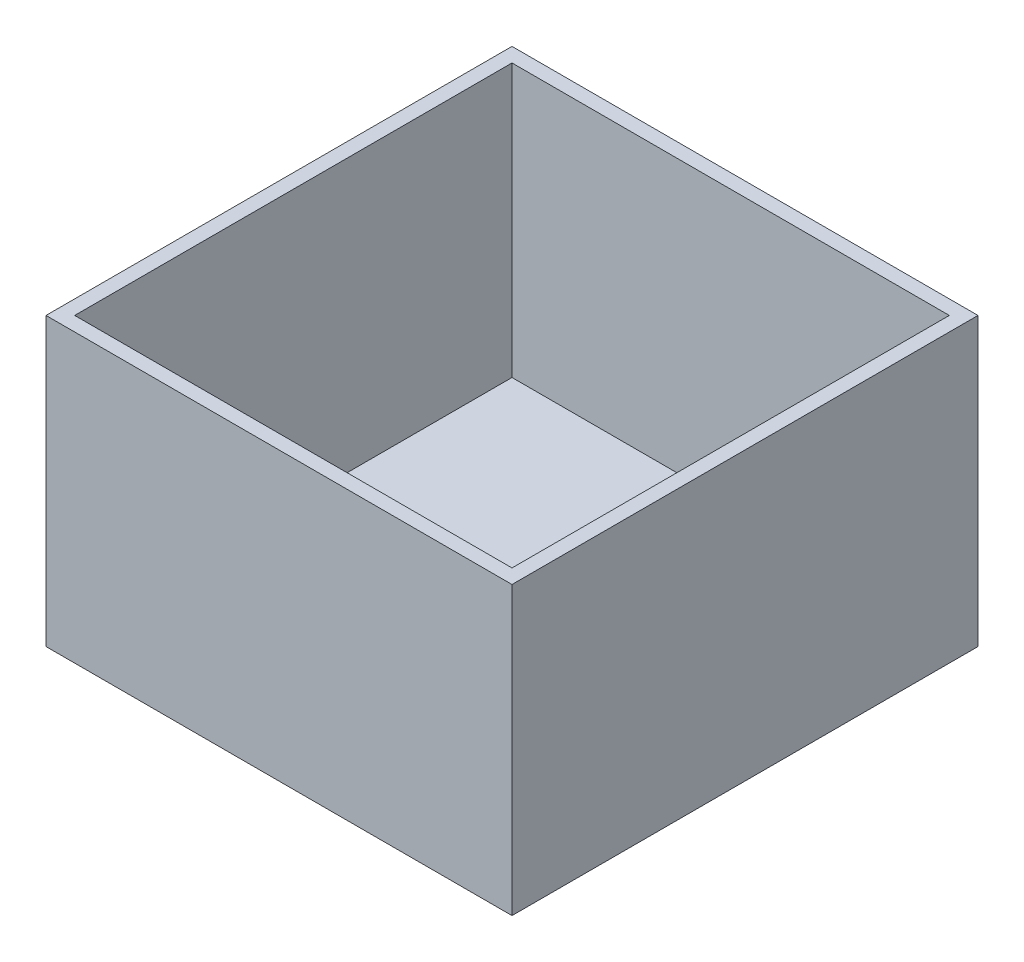
ISO-10303-21;
HEADER;
FILE_DESCRIPTION(('STEP AP214'),'2;1');
FILE_NAME('part.step','',(''),(''),'','','');
FILE_SCHEMA(('AUTOMOTIVE_DESIGN { 1 0 10303 214 1 1 1 1 }'));
ENDSEC;
DATA;
#1=APPLICATION_CONTEXT('core data for automotive mechanical design processes');
#2=APPLICATION_PROTOCOL_DEFINITION('international standard','automotive_design',2000,#1);
#3=PRODUCT_CONTEXT('',#1,'mechanical');
#4=PRODUCT('Part','Part','',(#3));
#5=PRODUCT_RELATED_PRODUCT_CATEGORY('part','',(#4));
#6=PRODUCT_DEFINITION_FORMATION('','',#4);
#7=PRODUCT_DEFINITION_CONTEXT('part definition',#1,'design');
#8=PRODUCT_DEFINITION('design','',#6,#7);
#9=PRODUCT_DEFINITION_SHAPE('','',#8);
#10=(LENGTH_UNIT() NAMED_UNIT(*) SI_UNIT(.MILLI.,.METRE.));
#11=(NAMED_UNIT(*) PLANE_ANGLE_UNIT() SI_UNIT($,.RADIAN.));
#12=(NAMED_UNIT(*) SI_UNIT($,.STERADIAN.) SOLID_ANGLE_UNIT());
#13=UNCERTAINTY_MEASURE_WITH_UNIT(LENGTH_MEASURE(1.E-05),#10,'distance_accuracy_value','');
#14=(GEOMETRIC_REPRESENTATION_CONTEXT(3) GLOBAL_UNCERTAINTY_ASSIGNED_CONTEXT((#13)) GLOBAL_UNIT_ASSIGNED_CONTEXT((#10,
#11,#12)) REPRESENTATION_CONTEXT('',''));
#15=CARTESIAN_POINT('',(0.,0.,0.));
#16=DIRECTION('',(0.,0.,1.));
#17=DIRECTION('',(1.,0.,0.));
#18=AXIS2_PLACEMENT_3D('',#15,#16,#17);
#19=CARTESIAN_POINT('',(0.,50.8,0.));
#20=DIRECTION('',(1.,0.,0.));
#21=DIRECTION('',(0.,0.,-1.));
#22=AXIS2_PLACEMENT_3D('',#19,#20,#21);
#23=PLANE('',#22);
#24=DIRECTION('',(0.,0.,1.));
#25=VECTOR('',#24,1.);
#26=CARTESIAN_POINT('',(0.,0.,0.));
#27=LINE('',#26,#25);
#28=CARTESIAN_POINT('',(0.,0.,0.));
#29=VERTEX_POINT('',#28);
#30=CARTESIAN_POINT('',(0.,0.,82.55));
#31=VERTEX_POINT('',#30);
#32=EDGE_CURVE('E148',#29,#31,#27,.T.);
#33=ORIENTED_EDGE('',*,*,#32,.T.);
#34=DIRECTION('',(0.,-1.,0.));
#35=VECTOR('',#34,1.);
#36=CARTESIAN_POINT('',(0.,50.8,82.55));
#37=LINE('',#36,#35);
#38=CARTESIAN_POINT('',(0.,50.8,82.55));
#39=VERTEX_POINT('',#38);
#40=EDGE_CURVE('E11',#39,#31,#37,.T.);
#41=ORIENTED_EDGE('',*,*,#40,.F.);
#42=DIRECTION('',(0.,0.,1.));
#43=VECTOR('',#42,1.);
#44=CARTESIAN_POINT('',(0.,50.8,0.));
#45=LINE('',#44,#43);
#46=CARTESIAN_POINT('',(0.,50.8,0.));
#47=VERTEX_POINT('',#46);
#48=EDGE_CURVE('E141',#47,#39,#45,.T.);
#49=ORIENTED_EDGE('',*,*,#48,.F.);
#50=DIRECTION('',(0.,-1.,0.));
#51=VECTOR('',#50,1.);
#52=CARTESIAN_POINT('',(0.,50.8,0.));
#53=LINE('',#52,#51);
#54=EDGE_CURVE('E147',#47,#29,#53,.T.);
#55=ORIENTED_EDGE('',*,*,#54,.T.);
#56=EDGE_LOOP('',(#33,#41,#49,#55));
#57=FACE_BOUND('',#56,.T.);
#58=ADVANCED_FACE('F34',(#57),#23,.F.);
#59=CARTESIAN_POINT('',(0.,50.8,82.55));
#60=DIRECTION('',(0.,0.,-1.));
#61=DIRECTION('',(-1.,0.,0.));
#62=AXIS2_PLACEMENT_3D('',#59,#60,#61);
#63=PLANE('',#62);
#64=DIRECTION('',(1.,0.,0.));
#65=VECTOR('',#64,1.);
#66=CARTESIAN_POINT('',(0.,0.,82.55));
#67=LINE('',#66,#65);
#68=CARTESIAN_POINT('',(82.55,0.,82.55));
#69=VERTEX_POINT('',#68);
#70=EDGE_CURVE('E151',#31,#69,#67,.T.);
#71=ORIENTED_EDGE('',*,*,#70,.T.);
#72=DIRECTION('',(0.,-1.,0.));
#73=VECTOR('',#72,1.);
#74=CARTESIAN_POINT('',(82.55,50.8,82.55));
#75=LINE('',#74,#73);
#76=CARTESIAN_POINT('',(82.55,50.8,82.55));
#77=VERTEX_POINT('',#76);
#78=EDGE_CURVE('E41',#77,#69,#75,.T.);
#79=ORIENTED_EDGE('',*,*,#78,.F.);
#80=DIRECTION('',(1.,0.,0.));
#81=VECTOR('',#80,1.);
#82=CARTESIAN_POINT('',(0.,50.8,82.55));
#83=LINE('',#82,#81);
#84=EDGE_CURVE('E85',#39,#77,#83,.T.);
#85=ORIENTED_EDGE('',*,*,#84,.F.);
#86=ORIENTED_EDGE('',*,*,#40,.T.);
#87=EDGE_LOOP('',(#71,#79,#85,#86));
#88=FACE_BOUND('',#87,.T.);
#89=ADVANCED_FACE('F180',(#88),#63,.F.);
#90=CARTESIAN_POINT('',(82.55,50.8,0.));
#91=DIRECTION('',(-1.,0.,0.));
#92=DIRECTION('',(0.,0.,1.));
#93=AXIS2_PLACEMENT_3D('',#90,#91,#92);
#94=PLANE('',#93);
#95=DIRECTION('',(0.,0.,-1.));
#96=VECTOR('',#95,1.);
#97=CARTESIAN_POINT('',(82.55,0.,0.));
#98=LINE('',#97,#96);
#99=CARTESIAN_POINT('',(82.55,0.,0.));
#100=VERTEX_POINT('',#99);
#101=EDGE_CURVE('E153',#69,#100,#98,.T.);
#102=ORIENTED_EDGE('',*,*,#101,.T.);
#103=DIRECTION('',(0.,-1.,0.));
#104=VECTOR('',#103,1.);
#105=CARTESIAN_POINT('',(82.55,50.8,0.));
#106=LINE('',#105,#104);
#107=CARTESIAN_POINT('',(82.55,50.8,0.));
#108=VERTEX_POINT('',#107);
#109=EDGE_CURVE('E157',#108,#100,#106,.T.);
#110=ORIENTED_EDGE('',*,*,#109,.F.);
#111=DIRECTION('',(0.,0.,-1.));
#112=VECTOR('',#111,1.);
#113=CARTESIAN_POINT('',(82.55,50.8,0.));
#114=LINE('',#113,#112);
#115=EDGE_CURVE('E144',#77,#108,#114,.T.);
#116=ORIENTED_EDGE('',*,*,#115,.F.);
#117=ORIENTED_EDGE('',*,*,#78,.T.);
#118=EDGE_LOOP('',(#102,#110,#116,#117));
#119=FACE_BOUND('',#118,.T.);
#120=ADVANCED_FACE('F162',(#119),#94,.F.);
#121=CARTESIAN_POINT('',(0.,50.8,0.));
#122=DIRECTION('',(0.,0.,1.));
#123=DIRECTION('',(1.,0.,0.));
#124=AXIS2_PLACEMENT_3D('',#121,#122,#123);
#125=PLANE('',#124);
#126=DIRECTION('',(-1.,0.,0.));
#127=VECTOR('',#126,1.);
#128=CARTESIAN_POINT('',(0.,0.,0.));
#129=LINE('',#128,#127);
#130=EDGE_CURVE('E78',#100,#29,#129,.T.);
#131=ORIENTED_EDGE('',*,*,#130,.T.);
#132=ORIENTED_EDGE('',*,*,#54,.F.);
#133=DIRECTION('',(-1.,0.,0.));
#134=VECTOR('',#133,1.);
#135=CARTESIAN_POINT('',(0.,50.8,0.));
#136=LINE('',#135,#134);
#137=EDGE_CURVE('E57',#108,#47,#136,.T.);
#138=ORIENTED_EDGE('',*,*,#137,.F.);
#139=ORIENTED_EDGE('',*,*,#109,.T.);
#140=EDGE_LOOP('',(#131,#132,#138,#139));
#141=FACE_BOUND('',#140,.T.);
#142=ADVANCED_FACE('F170',(#141),#125,.F.);
#143=CARTESIAN_POINT('',(0.,50.8,0.));
#144=DIRECTION('',(0.,1.,0.));
#145=DIRECTION('',(0.,0.,1.));
#146=AXIS2_PLACEMENT_3D('',#143,#144,#145);
#147=PLANE('',#146);
#148=DIRECTION('',(0.,0.,1.));
#149=VECTOR('',#148,1.);
#150=CARTESIAN_POINT('',(2.54,50.8,0.));
#151=LINE('',#150,#149);
#152=CARTESIAN_POINT('',(2.54,50.8,2.54));
#153=VERTEX_POINT('',#152);
#154=CARTESIAN_POINT('',(2.54000000000001,50.8,80.01));
#155=VERTEX_POINT('',#154);
#156=EDGE_CURVE('E130',#153,#155,#151,.T.);
#157=ORIENTED_EDGE('',*,*,#156,.F.);
#158=DIRECTION('',(-1.,0.,0.));
#159=VECTOR('',#158,1.);
#160=CARTESIAN_POINT('',(0.,50.8,2.54));
#161=LINE('',#160,#159);
#162=CARTESIAN_POINT('',(80.01,50.8,2.54));
#163=VERTEX_POINT('',#162);
#164=EDGE_CURVE('E139',#163,#153,#161,.T.);
#165=ORIENTED_EDGE('',*,*,#164,.F.);
#166=DIRECTION('',(0.,0.,-1.));
#167=VECTOR('',#166,1.);
#168=CARTESIAN_POINT('',(80.01,50.8,0.));
#169=LINE('',#168,#167);
#170=CARTESIAN_POINT('',(80.01,50.8,80.01));
#171=VERTEX_POINT('',#170);
#172=EDGE_CURVE('E137',#171,#163,#169,.T.);
#173=ORIENTED_EDGE('',*,*,#172,.F.);
#174=DIRECTION('',(1.,0.,0.));
#175=VECTOR('',#174,1.);
#176=CARTESIAN_POINT('',(0.,50.8,80.01));
#177=LINE('',#176,#175);
#178=EDGE_CURVE('E122',#155,#171,#177,.T.);
#179=ORIENTED_EDGE('',*,*,#178,.F.);
#180=EDGE_LOOP('',(#157,#165,#173,#179));
#181=FACE_BOUND('',#180,.T.);
#182=ORIENTED_EDGE('',*,*,#48,.T.);
#183=ORIENTED_EDGE('',*,*,#84,.T.);
#184=ORIENTED_EDGE('',*,*,#115,.T.);
#185=ORIENTED_EDGE('',*,*,#137,.T.);
#186=EDGE_LOOP('',(#182,#183,#184,#185));
#187=FACE_BOUND('',#186,.T.);
#188=ADVANCED_FACE('F172',(#181,#187),#147,.T.);
#189=CARTESIAN_POINT('',(0.,0.,0.));
#190=DIRECTION('',(0.,1.,0.));
#191=DIRECTION('',(0.,0.,1.));
#192=AXIS2_PLACEMENT_3D('',#189,#190,#191);
#193=PLANE('',#192);
#194=ORIENTED_EDGE('',*,*,#32,.F.);
#195=ORIENTED_EDGE('',*,*,#130,.F.);
#196=ORIENTED_EDGE('',*,*,#101,.F.);
#197=ORIENTED_EDGE('',*,*,#70,.F.);
#198=EDGE_LOOP('',(#194,#195,#196,#197));
#199=FACE_BOUND('',#198,.T.);
#200=ADVANCED_FACE('F166',(#199),#193,.F.);
#201=CARTESIAN_POINT('',(2.54,50.8,0.));
#202=DIRECTION('',(1.,0.,0.));
#203=DIRECTION('',(0.,0.,-1.));
#204=AXIS2_PLACEMENT_3D('',#201,#202,#203);
#205=PLANE('',#204);
#206=DIRECTION('',(0.,0.,1.));
#207=VECTOR('',#206,1.);
#208=CARTESIAN_POINT('',(2.54,2.54,0.));
#209=LINE('',#208,#207);
#210=CARTESIAN_POINT('',(2.54,2.54,2.54));
#211=VERTEX_POINT('',#210);
#212=CARTESIAN_POINT('',(2.54000000000001,2.54,80.01));
#213=VERTEX_POINT('',#212);
#214=EDGE_CURVE('E113',#211,#213,#209,.T.);
#215=ORIENTED_EDGE('',*,*,#214,.F.);
#216=DIRECTION('',(0.,-1.,0.));
#217=VECTOR('',#216,1.);
#218=CARTESIAN_POINT('',(2.54,50.8,2.54));
#219=LINE('',#218,#217);
#220=EDGE_CURVE('E133',#153,#211,#219,.T.);
#221=ORIENTED_EDGE('',*,*,#220,.F.);
#222=ORIENTED_EDGE('',*,*,#156,.T.);
#223=DIRECTION('',(0.,-1.,0.));
#224=VECTOR('',#223,1.);
#225=CARTESIAN_POINT('',(2.54000000000001,50.8,80.01));
#226=LINE('',#225,#224);
#227=EDGE_CURVE('E125',#155,#213,#226,.T.);
#228=ORIENTED_EDGE('',*,*,#227,.T.);
#229=EDGE_LOOP('',(#215,#221,#222,#228));
#230=FACE_BOUND('',#229,.T.);
#231=ADVANCED_FACE('F207',(#230),#205,.T.);
#232=CARTESIAN_POINT('',(0.,50.8,80.01));
#233=DIRECTION('',(0.,0.,-1.));
#234=DIRECTION('',(-1.,0.,0.));
#235=AXIS2_PLACEMENT_3D('',#232,#233,#234);
#236=PLANE('',#235);
#237=DIRECTION('',(1.,0.,0.));
#238=VECTOR('',#237,1.);
#239=CARTESIAN_POINT('',(0.,2.54,80.01));
#240=LINE('',#239,#238);
#241=CARTESIAN_POINT('',(80.01,2.54,80.01));
#242=VERTEX_POINT('',#241);
#243=EDGE_CURVE('E107',#213,#242,#240,.T.);
#244=ORIENTED_EDGE('',*,*,#243,.F.);
#245=ORIENTED_EDGE('',*,*,#227,.F.);
#246=ORIENTED_EDGE('',*,*,#178,.T.);
#247=DIRECTION('',(0.,-1.,0.));
#248=VECTOR('',#247,1.);
#249=CARTESIAN_POINT('',(80.01,50.8,80.01));
#250=LINE('',#249,#248);
#251=EDGE_CURVE('E119',#171,#242,#250,.T.);
#252=ORIENTED_EDGE('',*,*,#251,.T.);
#253=EDGE_LOOP('',(#244,#245,#246,#252));
#254=FACE_BOUND('',#253,.T.);
#255=ADVANCED_FACE('F120',(#254),#236,.T.);
#256=CARTESIAN_POINT('',(80.01,50.8,0.));
#257=DIRECTION('',(-1.,0.,0.));
#258=DIRECTION('',(0.,0.,1.));
#259=AXIS2_PLACEMENT_3D('',#256,#257,#258);
#260=PLANE('',#259);
#261=DIRECTION('',(0.,0.,-1.));
#262=VECTOR('',#261,1.);
#263=CARTESIAN_POINT('',(80.01,2.54,0.));
#264=LINE('',#263,#262);
#265=CARTESIAN_POINT('',(80.01,2.54,2.54));
#266=VERTEX_POINT('',#265);
#267=EDGE_CURVE('E111',#242,#266,#264,.T.);
#268=ORIENTED_EDGE('',*,*,#267,.F.);
#269=ORIENTED_EDGE('',*,*,#251,.F.);
#270=ORIENTED_EDGE('',*,*,#172,.T.);
#271=DIRECTION('',(0.,-1.,0.));
#272=VECTOR('',#271,1.);
#273=CARTESIAN_POINT('',(80.01,50.8,2.54));
#274=LINE('',#273,#272);
#275=EDGE_CURVE('E48',#163,#266,#274,.T.);
#276=ORIENTED_EDGE('',*,*,#275,.T.);
#277=EDGE_LOOP('',(#268,#269,#270,#276));
#278=FACE_BOUND('',#277,.T.);
#279=ADVANCED_FACE('F127',(#278),#260,.T.);
#280=CARTESIAN_POINT('',(0.,50.8,2.54));
#281=DIRECTION('',(0.,0.,1.));
#282=DIRECTION('',(1.,0.,0.));
#283=AXIS2_PLACEMENT_3D('',#280,#281,#282);
#284=PLANE('',#283);
#285=DIRECTION('',(-1.,0.,0.));
#286=VECTOR('',#285,1.);
#287=CARTESIAN_POINT('',(0.,2.54,2.54));
#288=LINE('',#287,#286);
#289=EDGE_CURVE('E128',#266,#211,#288,.T.);
#290=ORIENTED_EDGE('',*,*,#289,.F.);
#291=ORIENTED_EDGE('',*,*,#275,.F.);
#292=ORIENTED_EDGE('',*,*,#164,.T.);
#293=ORIENTED_EDGE('',*,*,#220,.T.);
#294=EDGE_LOOP('',(#290,#291,#292,#293));
#295=FACE_BOUND('',#294,.T.);
#296=ADVANCED_FACE('F237',(#295),#284,.T.);
#297=CARTESIAN_POINT('',(0.,2.54,0.));
#298=DIRECTION('',(0.,1.,0.));
#299=DIRECTION('',(0.,0.,1.));
#300=AXIS2_PLACEMENT_3D('',#297,#298,#299);
#301=PLANE('',#300);
#302=ORIENTED_EDGE('',*,*,#214,.T.);
#303=ORIENTED_EDGE('',*,*,#243,.T.);
#304=ORIENTED_EDGE('',*,*,#267,.T.);
#305=ORIENTED_EDGE('',*,*,#289,.T.);
#306=EDGE_LOOP('',(#302,#303,#304,#305));
#307=FACE_BOUND('',#306,.T.);
#308=ADVANCED_FACE('F109',(#307),#301,.T.);
#309=CLOSED_SHELL('',(#58,#89,#120,#142,#188,#200,#231,#255,#279,#296,#308));
#310=MANIFOLD_SOLID_BREP('B2',#309);
#311=ADVANCED_BREP_SHAPE_REPRESENTATION('',(#18,#310),#14);
#312=SHAPE_DEFINITION_REPRESENTATION(#9,#311);
ENDSEC;
END-ISO-10303-21;
